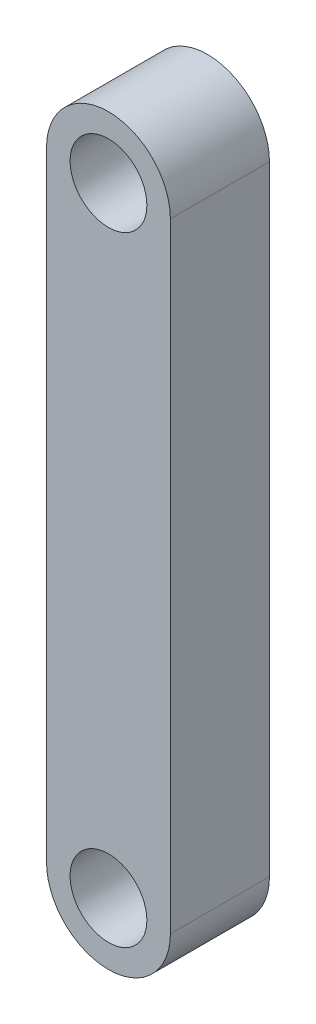
ISO-10303-21;
HEADER;
FILE_DESCRIPTION(('STEP AP214'),'2;1');
FILE_NAME('part.step','',(''),(''),'','','');
FILE_SCHEMA(('AUTOMOTIVE_DESIGN { 1 0 10303 214 1 1 1 1 }'));
ENDSEC;
DATA;
#1=APPLICATION_CONTEXT('core data for automotive mechanical design processes');
#2=APPLICATION_PROTOCOL_DEFINITION('international standard','automotive_design',2000,#1);
#3=PRODUCT_CONTEXT('',#1,'mechanical');
#4=PRODUCT('Part','Part','',(#3));
#5=PRODUCT_RELATED_PRODUCT_CATEGORY('part','',(#4));
#6=PRODUCT_DEFINITION_FORMATION('','',#4);
#7=PRODUCT_DEFINITION_CONTEXT('part definition',#1,'design');
#8=PRODUCT_DEFINITION('design','',#6,#7);
#9=PRODUCT_DEFINITION_SHAPE('','',#8);
#10=(LENGTH_UNIT() NAMED_UNIT(*) SI_UNIT(.MILLI.,.METRE.));
#11=(NAMED_UNIT(*) PLANE_ANGLE_UNIT() SI_UNIT($,.RADIAN.));
#12=(NAMED_UNIT(*) SI_UNIT($,.STERADIAN.) SOLID_ANGLE_UNIT());
#13=UNCERTAINTY_MEASURE_WITH_UNIT(LENGTH_MEASURE(1.E-05),#10,'distance_accuracy_value','');
#14=(GEOMETRIC_REPRESENTATION_CONTEXT(3) GLOBAL_UNCERTAINTY_ASSIGNED_CONTEXT((#13)) GLOBAL_UNIT_ASSIGNED_CONTEXT((#10,
#11,#12)) REPRESENTATION_CONTEXT('',''));
#15=CARTESIAN_POINT('',(0.,0.,0.));
#16=DIRECTION('',(0.,0.,1.));
#17=DIRECTION('',(1.,0.,0.));
#18=AXIS2_PLACEMENT_3D('',#15,#16,#17);
#19=CARTESIAN_POINT('',(0.,-12.5,4.));
#20=DIRECTION('',(0.,0.,1.));
#21=DIRECTION('',(1.,0.,0.));
#22=AXIS2_PLACEMENT_3D('',#19,#20,#21);
#23=PLANE('',#22);
#24=CARTESIAN_POINT('',(0.,12.5,4.));
#25=DIRECTION('',(0.,0.,1.));
#26=DIRECTION('',(1.,0.,0.));
#27=AXIS2_PLACEMENT_3D('',#24,#25,#26);
#28=CIRCLE('',#27,1.55);
#29=CARTESIAN_POINT('',(1.55,12.5,4.));
#30=VERTEX_POINT('',#29);
#31=EDGE_CURVE('E106',#30,#30,#28,.T.);
#32=ORIENTED_EDGE('',*,*,#31,.F.);
#33=EDGE_LOOP('',(#32));
#34=FACE_BOUND('',#33,.T.);
#35=CARTESIAN_POINT('',(0.,-12.5,4.));
#36=DIRECTION('',(0.,0.,1.));
#37=DIRECTION('',(1.,0.,0.));
#38=AXIS2_PLACEMENT_3D('',#35,#36,#37);
#39=CIRCLE('',#38,2.5);
#40=CARTESIAN_POINT('',(-2.5,-12.5,4.));
#41=VERTEX_POINT('',#40);
#42=CARTESIAN_POINT('',(2.5,-12.5,4.));
#43=VERTEX_POINT('',#42);
#44=EDGE_CURVE('E91',#41,#43,#39,.T.);
#45=ORIENTED_EDGE('',*,*,#44,.T.);
#46=DIRECTION('',(0.,1.,0.));
#47=VECTOR('',#46,1.);
#48=CARTESIAN_POINT('',(2.5,-12.5,4.));
#49=LINE('',#48,#47);
#50=CARTESIAN_POINT('',(2.5,12.5,4.));
#51=VERTEX_POINT('',#50);
#52=EDGE_CURVE('E86',#43,#51,#49,.T.);
#53=ORIENTED_EDGE('',*,*,#52,.T.);
#54=CARTESIAN_POINT('',(0.,12.5,4.));
#55=DIRECTION('',(0.,0.,1.));
#56=DIRECTION('',(-1.,0.,0.));
#57=AXIS2_PLACEMENT_3D('',#54,#55,#56);
#58=CIRCLE('',#57,2.5);
#59=CARTESIAN_POINT('',(-2.5,12.5,4.));
#60=VERTEX_POINT('',#59);
#61=EDGE_CURVE('E89',#51,#60,#58,.T.);
#62=ORIENTED_EDGE('',*,*,#61,.T.);
#63=DIRECTION('',(0.,-1.,0.));
#64=VECTOR('',#63,1.);
#65=CARTESIAN_POINT('',(-2.5,-12.5,4.));
#66=LINE('',#65,#64);
#67=EDGE_CURVE('E56',#60,#41,#66,.T.);
#68=ORIENTED_EDGE('',*,*,#67,.T.);
#69=EDGE_LOOP('',(#45,#53,#62,#68));
#70=FACE_BOUND('',#69,.T.);
#71=CARTESIAN_POINT('',(0.,-12.5,4.));
#72=DIRECTION('',(0.,0.,1.));
#73=DIRECTION('',(1.,0.,0.));
#74=AXIS2_PLACEMENT_3D('',#71,#72,#73);
#75=CIRCLE('',#74,1.55);
#76=CARTESIAN_POINT('',(1.55,-12.5,4.));
#77=VERTEX_POINT('',#76);
#78=EDGE_CURVE('E121',#77,#77,#75,.T.);
#79=ORIENTED_EDGE('',*,*,#78,.F.);
#80=EDGE_LOOP('',(#79));
#81=FACE_BOUND('',#80,.T.);
#82=ADVANCED_FACE('F39',(#34,#70,#81),#23,.T.);
#83=CARTESIAN_POINT('',(0.,-12.5,0.));
#84=DIRECTION('',(0.,0.,1.));
#85=DIRECTION('',(1.,0.,0.));
#86=AXIS2_PLACEMENT_3D('',#83,#84,#85);
#87=PLANE('',#86);
#88=CARTESIAN_POINT('',(0.,-12.5,0.));
#89=DIRECTION('',(0.,0.,1.));
#90=DIRECTION('',(1.,0.,0.));
#91=AXIS2_PLACEMENT_3D('',#88,#89,#90);
#92=CIRCLE('',#91,2.5);
#93=CARTESIAN_POINT('',(-2.5,-12.5,0.));
#94=VERTEX_POINT('',#93);
#95=CARTESIAN_POINT('',(2.5,-12.5,0.));
#96=VERTEX_POINT('',#95);
#97=EDGE_CURVE('E103',#94,#96,#92,.T.);
#98=ORIENTED_EDGE('',*,*,#97,.F.);
#99=DIRECTION('',(0.,-1.,0.));
#100=VECTOR('',#99,1.);
#101=CARTESIAN_POINT('',(-2.5,-12.5,0.));
#102=LINE('',#101,#100);
#103=CARTESIAN_POINT('',(-2.5,12.5,0.));
#104=VERTEX_POINT('',#103);
#105=EDGE_CURVE('E79',#104,#94,#102,.T.);
#106=ORIENTED_EDGE('',*,*,#105,.F.);
#107=CARTESIAN_POINT('',(0.,12.5,0.));
#108=DIRECTION('',(0.,0.,1.));
#109=DIRECTION('',(-1.,0.,0.));
#110=AXIS2_PLACEMENT_3D('',#107,#108,#109);
#111=CIRCLE('',#110,2.5);
#112=CARTESIAN_POINT('',(2.5,12.5,0.));
#113=VERTEX_POINT('',#112);
#114=EDGE_CURVE('E73',#113,#104,#111,.T.);
#115=ORIENTED_EDGE('',*,*,#114,.F.);
#116=DIRECTION('',(0.,1.,0.));
#117=VECTOR('',#116,1.);
#118=CARTESIAN_POINT('',(2.5,-12.5,0.));
#119=LINE('',#118,#117);
#120=EDGE_CURVE('E95',#96,#113,#119,.T.);
#121=ORIENTED_EDGE('',*,*,#120,.F.);
#122=EDGE_LOOP('',(#98,#106,#115,#121));
#123=FACE_BOUND('',#122,.T.);
#124=CARTESIAN_POINT('',(0.,12.5,0.));
#125=DIRECTION('',(0.,0.,1.));
#126=DIRECTION('',(1.,0.,0.));
#127=AXIS2_PLACEMENT_3D('',#124,#125,#126);
#128=CIRCLE('',#127,1.55);
#129=CARTESIAN_POINT('',(1.55,12.5,0.));
#130=VERTEX_POINT('',#129);
#131=EDGE_CURVE('E118',#130,#130,#128,.T.);
#132=ORIENTED_EDGE('',*,*,#131,.T.);
#133=EDGE_LOOP('',(#132));
#134=FACE_BOUND('',#133,.T.);
#135=CARTESIAN_POINT('',(0.,-12.5,0.));
#136=DIRECTION('',(0.,0.,1.));
#137=DIRECTION('',(1.,0.,0.));
#138=AXIS2_PLACEMENT_3D('',#135,#136,#137);
#139=CIRCLE('',#138,1.55);
#140=CARTESIAN_POINT('',(1.55,-12.5,0.));
#141=VERTEX_POINT('',#140);
#142=EDGE_CURVE('E124',#141,#141,#139,.T.);
#143=ORIENTED_EDGE('',*,*,#142,.T.);
#144=EDGE_LOOP('',(#143));
#145=FACE_BOUND('',#144,.T.);
#146=ADVANCED_FACE('F114',(#123,#134,#145),#87,.F.);
#147=CARTESIAN_POINT('',(0.,-12.5,4.));
#148=DIRECTION('',(0.,0.,-1.));
#149=DIRECTION('',(-1.,0.,0.));
#150=AXIS2_PLACEMENT_3D('',#147,#148,#149);
#151=CYLINDRICAL_SURFACE('',#150,2.5);
#152=ORIENTED_EDGE('',*,*,#97,.T.);
#153=DIRECTION('',(0.,0.,-1.));
#154=VECTOR('',#153,1.);
#155=CARTESIAN_POINT('',(2.5,-12.5,4.));
#156=LINE('',#155,#154);
#157=EDGE_CURVE('E11',#43,#96,#156,.T.);
#158=ORIENTED_EDGE('',*,*,#157,.F.);
#159=ORIENTED_EDGE('',*,*,#44,.F.);
#160=DIRECTION('',(0.,0.,-1.));
#161=VECTOR('',#160,1.);
#162=CARTESIAN_POINT('',(-2.5,-12.5,4.));
#163=LINE('',#162,#161);
#164=EDGE_CURVE('E99',#41,#94,#163,.T.);
#165=ORIENTED_EDGE('',*,*,#164,.T.);
#166=EDGE_LOOP('',(#152,#158,#159,#165));
#167=FACE_BOUND('',#166,.T.);
#168=ADVANCED_FACE('F41',(#167),#151,.T.);
#169=CARTESIAN_POINT('',(2.5,-12.5,4.));
#170=DIRECTION('',(-1.,0.,0.));
#171=DIRECTION('',(0.,0.,1.));
#172=AXIS2_PLACEMENT_3D('',#169,#170,#171);
#173=PLANE('',#172);
#174=ORIENTED_EDGE('',*,*,#120,.T.);
#175=DIRECTION('',(0.,0.,-1.));
#176=VECTOR('',#175,1.);
#177=CARTESIAN_POINT('',(2.5,12.5,4.));
#178=LINE('',#177,#176);
#179=EDGE_CURVE('E48',#51,#113,#178,.T.);
#180=ORIENTED_EDGE('',*,*,#179,.F.);
#181=ORIENTED_EDGE('',*,*,#52,.F.);
#182=ORIENTED_EDGE('',*,*,#157,.T.);
#183=EDGE_LOOP('',(#174,#180,#181,#182));
#184=FACE_BOUND('',#183,.T.);
#185=ADVANCED_FACE('F94',(#184),#173,.F.);
#186=CARTESIAN_POINT('',(0.,12.5,4.));
#187=DIRECTION('',(0.,0.,-1.));
#188=DIRECTION('',(-1.,0.,0.));
#189=AXIS2_PLACEMENT_3D('',#186,#187,#188);
#190=CYLINDRICAL_SURFACE('',#189,2.5);
#191=ORIENTED_EDGE('',*,*,#114,.T.);
#192=DIRECTION('',(0.,0.,-1.));
#193=VECTOR('',#192,1.);
#194=CARTESIAN_POINT('',(-2.5,12.5,4.));
#195=LINE('',#194,#193);
#196=EDGE_CURVE('E96',#60,#104,#195,.T.);
#197=ORIENTED_EDGE('',*,*,#196,.F.);
#198=ORIENTED_EDGE('',*,*,#61,.F.);
#199=ORIENTED_EDGE('',*,*,#179,.T.);
#200=EDGE_LOOP('',(#191,#197,#198,#199));
#201=FACE_BOUND('',#200,.T.);
#202=ADVANCED_FACE('F97',(#201),#190,.T.);
#203=CARTESIAN_POINT('',(-2.5,-12.5,4.));
#204=DIRECTION('',(1.,0.,0.));
#205=DIRECTION('',(0.,0.,-1.));
#206=AXIS2_PLACEMENT_3D('',#203,#204,#205);
#207=PLANE('',#206);
#208=ORIENTED_EDGE('',*,*,#105,.T.);
#209=ORIENTED_EDGE('',*,*,#164,.F.);
#210=ORIENTED_EDGE('',*,*,#67,.F.);
#211=ORIENTED_EDGE('',*,*,#196,.T.);
#212=EDGE_LOOP('',(#208,#209,#210,#211));
#213=FACE_BOUND('',#212,.T.);
#214=ADVANCED_FACE('F111',(#213),#207,.F.);
#215=CARTESIAN_POINT('',(0.,12.5,4.));
#216=DIRECTION('',(0.,0.,-1.));
#217=DIRECTION('',(-1.,0.,0.));
#218=AXIS2_PLACEMENT_3D('',#215,#216,#217);
#219=CYLINDRICAL_SURFACE('',#218,1.55);
#220=ORIENTED_EDGE('',*,*,#31,.T.);
#221=EDGE_LOOP('',(#220));
#222=FACE_BOUND('',#221,.T.);
#223=ORIENTED_EDGE('',*,*,#131,.F.);
#224=EDGE_LOOP('',(#223));
#225=FACE_BOUND('',#224,.T.);
#226=ADVANCED_FACE('F141',(#222,#225),#219,.F.);
#227=CARTESIAN_POINT('',(0.,-12.5,4.));
#228=DIRECTION('',(0.,0.,-1.));
#229=DIRECTION('',(-1.,0.,0.));
#230=AXIS2_PLACEMENT_3D('',#227,#228,#229);
#231=CYLINDRICAL_SURFACE('',#230,1.55);
#232=ORIENTED_EDGE('',*,*,#78,.T.);
#233=EDGE_LOOP('',(#232));
#234=FACE_BOUND('',#233,.T.);
#235=ORIENTED_EDGE('',*,*,#142,.F.);
#236=EDGE_LOOP('',(#235));
#237=FACE_BOUND('',#236,.T.);
#238=ADVANCED_FACE('F130',(#234,#237),#231,.F.);
#239=CLOSED_SHELL('',(#82,#146,#168,#185,#202,#214,#226,#238));
#240=MANIFOLD_SOLID_BREP('B2',#239);
#241=ADVANCED_BREP_SHAPE_REPRESENTATION('',(#18,#240),#14);
#242=SHAPE_DEFINITION_REPRESENTATION(#9,#241);
ENDSEC;
END-ISO-10303-21;
